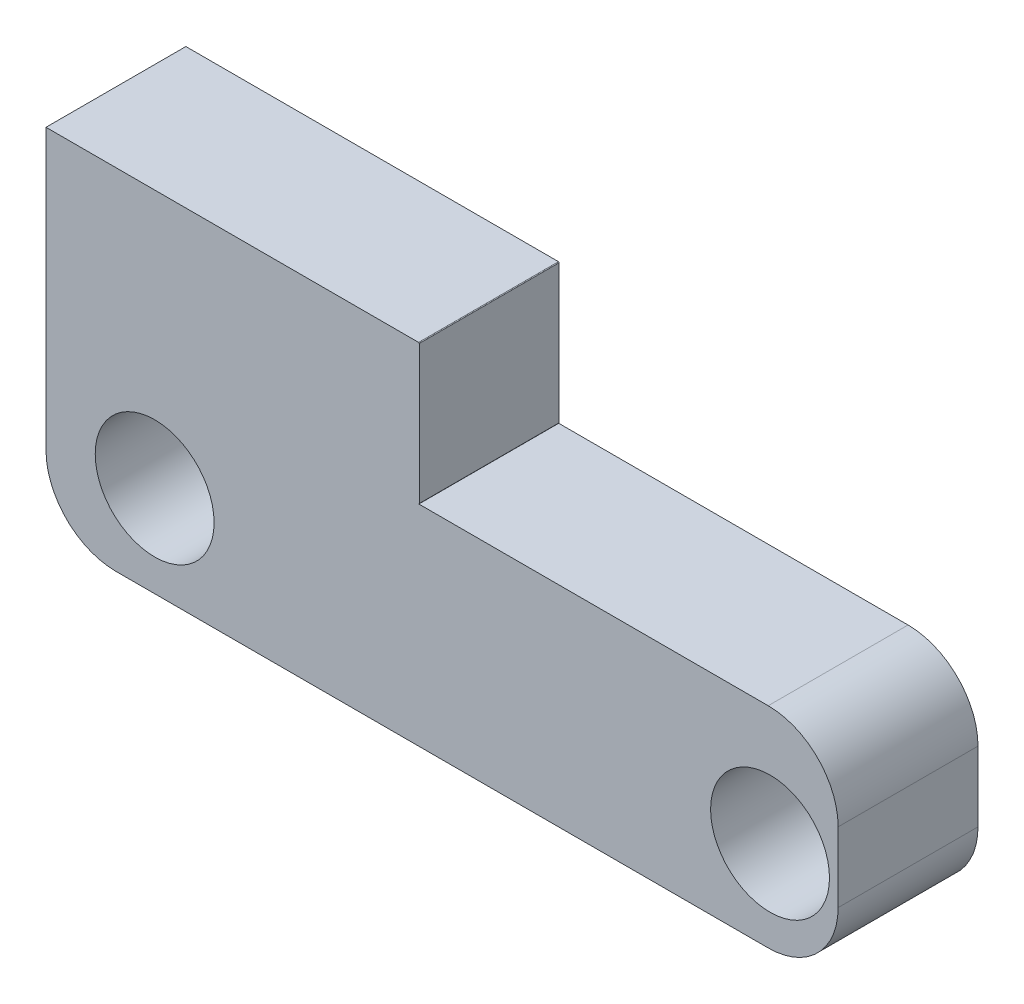
ISO-10303-21;
HEADER;
FILE_DESCRIPTION(('STEP AP214'),'2;1');
FILE_NAME('part.step','',(''),(''),'','','');
FILE_SCHEMA(('AUTOMOTIVE_DESIGN { 1 0 10303 214 1 1 1 1 }'));
ENDSEC;
DATA;
#1=APPLICATION_CONTEXT('core data for automotive mechanical design processes');
#2=APPLICATION_PROTOCOL_DEFINITION('international standard','automotive_design',2000,#1);
#3=PRODUCT_CONTEXT('',#1,'mechanical');
#4=PRODUCT('Part','Part','',(#3));
#5=PRODUCT_RELATED_PRODUCT_CATEGORY('part','',(#4));
#6=PRODUCT_DEFINITION_FORMATION('','',#4);
#7=PRODUCT_DEFINITION_CONTEXT('part definition',#1,'design');
#8=PRODUCT_DEFINITION('design','',#6,#7);
#9=PRODUCT_DEFINITION_SHAPE('','',#8);
#10=(LENGTH_UNIT() NAMED_UNIT(*) SI_UNIT(.MILLI.,.METRE.));
#11=(NAMED_UNIT(*) PLANE_ANGLE_UNIT() SI_UNIT($,.RADIAN.));
#12=(NAMED_UNIT(*) SI_UNIT($,.STERADIAN.) SOLID_ANGLE_UNIT());
#13=UNCERTAINTY_MEASURE_WITH_UNIT(LENGTH_MEASURE(1.E-05),#10,'distance_accuracy_value','');
#14=(GEOMETRIC_REPRESENTATION_CONTEXT(3) GLOBAL_UNCERTAINTY_ASSIGNED_CONTEXT((#13)) GLOBAL_UNIT_ASSIGNED_CONTEXT((#10,
#11,#12)) REPRESENTATION_CONTEXT('',''));
#15=CARTESIAN_POINT('',(0.,0.,0.));
#16=DIRECTION('',(0.,0.,1.));
#17=DIRECTION('',(1.,0.,0.));
#18=AXIS2_PLACEMENT_3D('',#15,#16,#17);
#19=CARTESIAN_POINT('',(-0.05,0.05,10.));
#20=DIRECTION('',(0.,0.,-1.));
#21=DIRECTION('',(-1.,0.,0.));
#22=AXIS2_PLACEMENT_3D('',#19,#20,#21);
#23=CYLINDRICAL_SURFACE('',#22,0.05);
#24=CARTESIAN_POINT('',(-0.05,0.05,0.));
#25=DIRECTION('',(0.,0.,1.));
#26=DIRECTION('',(1.,0.,0.));
#27=AXIS2_PLACEMENT_3D('',#24,#25,#26);
#28=CIRCLE('',#27,0.05);
#29=CARTESIAN_POINT('',(-0.05,0.,0.));
#30=VERTEX_POINT('',#29);
#31=CARTESIAN_POINT('',(0.,0.05,0.));
#32=VERTEX_POINT('',#31);
#33=EDGE_CURVE('E129',#30,#32,#28,.T.);
#34=ORIENTED_EDGE('',*,*,#33,.T.);
#35=DIRECTION('',(0.,0.,-1.));
#36=VECTOR('',#35,1.);
#37=CARTESIAN_POINT('',(0.,0.05,10.));
#38=LINE('',#37,#36);
#39=CARTESIAN_POINT('',(0.,0.05,10.));
#40=VERTEX_POINT('',#39);
#41=EDGE_CURVE('E133',#40,#32,#38,.T.);
#42=ORIENTED_EDGE('',*,*,#41,.F.);
#43=CARTESIAN_POINT('',(-0.05,0.05,10.));
#44=DIRECTION('',(0.,0.,1.));
#45=DIRECTION('',(1.,0.,0.));
#46=AXIS2_PLACEMENT_3D('',#43,#44,#45);
#47=CIRCLE('',#46,0.05);
#48=CARTESIAN_POINT('',(-0.05,0.,10.));
#49=VERTEX_POINT('',#48);
#50=EDGE_CURVE('E131',#49,#40,#47,.T.);
#51=ORIENTED_EDGE('',*,*,#50,.F.);
#52=DIRECTION('',(0.,0.,-1.));
#53=VECTOR('',#52,1.);
#54=CARTESIAN_POINT('',(-0.05,0.,10.));
#55=LINE('',#54,#53);
#56=EDGE_CURVE('E118',#49,#30,#55,.T.);
#57=ORIENTED_EDGE('',*,*,#56,.T.);
#58=EDGE_LOOP('',(#34,#42,#51,#57));
#59=FACE_BOUND('',#58,.T.);
#60=ADVANCED_FACE('F33',(#59),#23,.T.);
#61=CARTESIAN_POINT('',(0.,0.05,10.));
#62=DIRECTION('',(-1.,0.,0.));
#63=DIRECTION('',(0.,-1.,0.));
#64=AXIS2_PLACEMENT_3D('',#61,#62,#63);
#65=PLANE('',#64);
#66=DIRECTION('',(0.,1.,0.));
#67=VECTOR('',#66,1.);
#68=CARTESIAN_POINT('',(0.,0.05,0.));
#69=LINE('',#68,#67);
#70=CARTESIAN_POINT('',(0.,9.95,0.));
#71=VERTEX_POINT('',#70);
#72=EDGE_CURVE('E139',#32,#71,#69,.T.);
#73=ORIENTED_EDGE('',*,*,#72,.T.);
#74=DIRECTION('',(0.,0.,-1.));
#75=VECTOR('',#74,1.);
#76=CARTESIAN_POINT('',(0.,9.95,10.));
#77=LINE('',#76,#75);
#78=CARTESIAN_POINT('',(0.,9.95,10.));
#79=VERTEX_POINT('',#78);
#80=EDGE_CURVE('E162',#79,#71,#77,.T.);
#81=ORIENTED_EDGE('',*,*,#80,.F.);
#82=DIRECTION('',(0.,1.,0.));
#83=VECTOR('',#82,1.);
#84=CARTESIAN_POINT('',(0.,0.05,10.));
#85=LINE('',#84,#83);
#86=EDGE_CURVE('E206',#40,#79,#85,.T.);
#87=ORIENTED_EDGE('',*,*,#86,.F.);
#88=ORIENTED_EDGE('',*,*,#41,.T.);
#89=EDGE_LOOP('',(#73,#81,#87,#88));
#90=FACE_BOUND('',#89,.T.);
#91=ADVANCED_FACE('F236',(#90),#65,.F.);
#92=CARTESIAN_POINT('',(-0.05,9.95,10.));
#93=DIRECTION('',(0.,0.,-1.));
#94=DIRECTION('',(-1.,0.,0.));
#95=AXIS2_PLACEMENT_3D('',#92,#93,#94);
#96=CYLINDRICAL_SURFACE('',#95,0.0499999999999998);
#97=CARTESIAN_POINT('',(-0.05,9.95,0.));
#98=DIRECTION('',(0.,0.,1.));
#99=DIRECTION('',(1.,0.,0.));
#100=AXIS2_PLACEMENT_3D('',#97,#98,#99);
#101=CIRCLE('',#100,0.0499999999999998);
#102=CARTESIAN_POINT('',(-0.05,10.,0.));
#103=VERTEX_POINT('',#102);
#104=EDGE_CURVE('E142',#71,#103,#101,.T.);
#105=ORIENTED_EDGE('',*,*,#104,.T.);
#106=DIRECTION('',(0.,0.,-1.));
#107=VECTOR('',#106,1.);
#108=CARTESIAN_POINT('',(-0.05,10.,10.));
#109=LINE('',#108,#107);
#110=CARTESIAN_POINT('',(-0.05,10.,10.));
#111=VERTEX_POINT('',#110);
#112=EDGE_CURVE('E159',#111,#103,#109,.T.);
#113=ORIENTED_EDGE('',*,*,#112,.F.);
#114=CARTESIAN_POINT('',(-0.05,9.95,10.));
#115=DIRECTION('',(0.,0.,1.));
#116=DIRECTION('',(1.,0.,0.));
#117=AXIS2_PLACEMENT_3D('',#114,#115,#116);
#118=CIRCLE('',#117,0.0499999999999998);
#119=EDGE_CURVE('E208',#79,#111,#118,.T.);
#120=ORIENTED_EDGE('',*,*,#119,.F.);
#121=ORIENTED_EDGE('',*,*,#80,.T.);
#122=EDGE_LOOP('',(#105,#113,#120,#121));
#123=FACE_BOUND('',#122,.T.);
#124=ADVANCED_FACE('F231',(#123),#96,.T.);
#125=CARTESIAN_POINT('',(-0.05,10.,10.));
#126=DIRECTION('',(0.,-1.,0.));
#127=DIRECTION('',(0.,0.,-1.));
#128=AXIS2_PLACEMENT_3D('',#125,#126,#127);
#129=PLANE('',#128);
#130=DIRECTION('',(-1.,0.,0.));
#131=VECTOR('',#130,1.);
#132=CARTESIAN_POINT('',(-0.05,10.,0.));
#133=LINE('',#132,#131);
#134=CARTESIAN_POINT('',(-26.6892333331814,10.,0.));
#135=VERTEX_POINT('',#134);
#136=EDGE_CURVE('E151',#103,#135,#133,.T.);
#137=ORIENTED_EDGE('',*,*,#136,.T.);
#138=DIRECTION('',(0.,0.,-1.));
#139=VECTOR('',#138,1.);
#140=CARTESIAN_POINT('',(-26.6892333331814,10.,10.));
#141=LINE('',#140,#139);
#142=CARTESIAN_POINT('',(-26.6892333331814,10.,10.));
#143=VERTEX_POINT('',#142);
#144=EDGE_CURVE('E156',#143,#135,#141,.T.);
#145=ORIENTED_EDGE('',*,*,#144,.F.);
#146=DIRECTION('',(-1.,0.,0.));
#147=VECTOR('',#146,1.);
#148=CARTESIAN_POINT('',(-0.05,10.,10.));
#149=LINE('',#148,#147);
#150=EDGE_CURVE('E209',#111,#143,#149,.T.);
#151=ORIENTED_EDGE('',*,*,#150,.F.);
#152=ORIENTED_EDGE('',*,*,#112,.T.);
#153=EDGE_LOOP('',(#137,#145,#151,#152));
#154=FACE_BOUND('',#153,.T.);
#155=ADVANCED_FACE('F228',(#154),#129,.F.);
#156=CARTESIAN_POINT('',(-26.6892333331814,0.,10.));
#157=DIRECTION('',(1.,0.,0.));
#158=DIRECTION('',(0.,0.,-1.));
#159=AXIS2_PLACEMENT_3D('',#156,#157,#158);
#160=PLANE('',#159);
#161=DIRECTION('',(0.,-1.,0.));
#162=VECTOR('',#161,1.);
#163=CARTESIAN_POINT('',(-26.6892333331814,0.,0.));
#164=LINE('',#163,#162);
#165=CARTESIAN_POINT('',(-26.6892333331814,-10.,0.));
#166=VERTEX_POINT('',#165);
#167=EDGE_CURVE('E153',#135,#166,#164,.T.);
#168=ORIENTED_EDGE('',*,*,#167,.T.);
#169=DIRECTION('',(0.,0.,-1.));
#170=VECTOR('',#169,1.);
#171=CARTESIAN_POINT('',(-26.6892333331814,-10.,10.));
#172=LINE('',#171,#170);
#173=CARTESIAN_POINT('',(-26.6892333331814,-10.,10.));
#174=VERTEX_POINT('',#173);
#175=EDGE_CURVE('E176',#166,#174,#172,.F.);
#176=ORIENTED_EDGE('',*,*,#175,.T.);
#177=DIRECTION('',(0.,-1.,0.));
#178=VECTOR('',#177,1.);
#179=CARTESIAN_POINT('',(-26.6892333331814,0.,10.));
#180=LINE('',#179,#178);
#181=EDGE_CURVE('E147',#143,#174,#180,.T.);
#182=ORIENTED_EDGE('',*,*,#181,.F.);
#183=ORIENTED_EDGE('',*,*,#144,.T.);
#184=EDGE_LOOP('',(#168,#176,#182,#183));
#185=FACE_BOUND('',#184,.T.);
#186=ADVANCED_FACE('F226',(#185),#160,.F.);
#187=CARTESIAN_POINT('',(-0.05,0.05,10.));
#188=DIRECTION('',(0.,0.,1.));
#189=DIRECTION('',(1.,0.,0.));
#190=AXIS2_PLACEMENT_3D('',#187,#188,#189);
#191=PLANE('',#190);
#192=CARTESIAN_POINT('',(25.08,-8.47333778363474,10.));
#193=DIRECTION('',(0.,0.,1.));
#194=DIRECTION('',(1.,0.,0.));
#195=AXIS2_PLACEMENT_3D('',#192,#193,#194);
#196=CIRCLE('',#195,4.25000000000001);
#197=CARTESIAN_POINT('',(29.3300000000001,-8.47333778363474,10.));
#198=VERTEX_POINT('',#197);
#199=EDGE_CURVE('E195',#198,#198,#196,.T.);
#200=ORIENTED_EDGE('',*,*,#199,.F.);
#201=EDGE_LOOP('',(#200));
#202=FACE_BOUND('',#201,.T.);
#203=CARTESIAN_POINT('',(-18.9199999999999,-8.47333778363472,10.));
#204=DIRECTION('',(0.,0.,1.));
#205=DIRECTION('',(1.,0.,0.));
#206=AXIS2_PLACEMENT_3D('',#203,#204,#205);
#207=CIRCLE('',#206,4.25000000000001);
#208=CARTESIAN_POINT('',(-14.6699999999999,-8.47333778363472,10.));
#209=VERTEX_POINT('',#208);
#210=EDGE_CURVE('E199',#209,#209,#207,.T.);
#211=ORIENTED_EDGE('',*,*,#210,.F.);
#212=EDGE_LOOP('',(#211));
#213=FACE_BOUND('',#212,.T.);
#214=ORIENTED_EDGE('',*,*,#181,.T.);
#215=CARTESIAN_POINT('',(-21.6892333331814,-10.,10.));
#216=DIRECTION('',(0.,0.,1.));
#217=DIRECTION('',(1.,0.,0.));
#218=AXIS2_PLACEMENT_3D('',#215,#216,#217);
#219=CIRCLE('',#218,5.);
#220=CARTESIAN_POINT('',(-21.6892333331814,-15.,10.));
#221=VERTEX_POINT('',#220);
#222=EDGE_CURVE('E180',#174,#221,#219,.T.);
#223=ORIENTED_EDGE('',*,*,#222,.T.);
#224=DIRECTION('',(-1.,0.,0.));
#225=VECTOR('',#224,1.);
#226=CARTESIAN_POINT('',(-0.0499999999999997,-15.,10.));
#227=LINE('',#226,#225);
#228=CARTESIAN_POINT('',(24.95,-15.,10.));
#229=VERTEX_POINT('',#228);
#230=EDGE_CURVE('E140',#229,#221,#227,.T.);
#231=ORIENTED_EDGE('',*,*,#230,.F.);
#232=CARTESIAN_POINT('',(24.95,-10.,10.));
#233=DIRECTION('',(0.,0.,1.));
#234=DIRECTION('',(1.,0.,0.));
#235=AXIS2_PLACEMENT_3D('',#232,#233,#234);
#236=CIRCLE('',#235,5.);
#237=CARTESIAN_POINT('',(29.95,-10.,10.));
#238=VERTEX_POINT('',#237);
#239=EDGE_CURVE('E54',#229,#238,#236,.T.);
#240=ORIENTED_EDGE('',*,*,#239,.T.);
#241=DIRECTION('',(0.,-1.,0.));
#242=VECTOR('',#241,1.);
#243=CARTESIAN_POINT('',(29.95,0.,10.));
#244=LINE('',#243,#242);
#245=CARTESIAN_POINT('',(29.95,-5.,10.));
#246=VERTEX_POINT('',#245);
#247=EDGE_CURVE('E192',#246,#238,#244,.T.);
#248=ORIENTED_EDGE('',*,*,#247,.F.);
#249=CARTESIAN_POINT('',(24.95,-5.,10.));
#250=DIRECTION('',(0.,0.,1.));
#251=DIRECTION('',(1.,0.,0.));
#252=AXIS2_PLACEMENT_3D('',#249,#250,#251);
#253=CIRCLE('',#252,5.);
#254=CARTESIAN_POINT('',(24.95,0.,10.));
#255=VERTEX_POINT('',#254);
#256=EDGE_CURVE('E48',#246,#255,#253,.T.);
#257=ORIENTED_EDGE('',*,*,#256,.T.);
#258=DIRECTION('',(-1.,0.,0.));
#259=VECTOR('',#258,1.);
#260=CARTESIAN_POINT('',(29.95,0.,10.));
#261=LINE('',#260,#259);
#262=EDGE_CURVE('E125',#255,#49,#261,.T.);
#263=ORIENTED_EDGE('',*,*,#262,.T.);
#264=ORIENTED_EDGE('',*,*,#50,.T.);
#265=ORIENTED_EDGE('',*,*,#86,.T.);
#266=ORIENTED_EDGE('',*,*,#119,.T.);
#267=ORIENTED_EDGE('',*,*,#150,.T.);
#268=EDGE_LOOP('',(#214,#223,#231,#240,#248,#257,#263,#264,#265,#266,#267));
#269=FACE_BOUND('',#268,.T.);
#270=ADVANCED_FACE('F215',(#202,#213,#269),#191,.T.);
#271=CARTESIAN_POINT('',(-0.05,0.05,0.));
#272=DIRECTION('',(0.,0.,1.));
#273=DIRECTION('',(1.,0.,0.));
#274=AXIS2_PLACEMENT_3D('',#271,#272,#273);
#275=PLANE('',#274);
#276=CARTESIAN_POINT('',(25.08,-8.47333778363474,0.));
#277=DIRECTION('',(0.,0.,-1.));
#278=DIRECTION('',(-1.,0.,0.));
#279=AXIS2_PLACEMENT_3D('',#276,#277,#278);
#280=CIRCLE('',#279,4.25000000000001);
#281=CARTESIAN_POINT('',(20.83,-8.47333778363474,0.));
#282=VERTEX_POINT('',#281);
#283=EDGE_CURVE('E385',#282,#282,#280,.T.);
#284=ORIENTED_EDGE('',*,*,#283,.F.);
#285=EDGE_LOOP('',(#284));
#286=FACE_BOUND('',#285,.T.);
#287=CARTESIAN_POINT('',(-18.9199999999999,-8.47333778363472,0.));
#288=DIRECTION('',(0.,0.,-1.));
#289=DIRECTION('',(-1.,0.,0.));
#290=AXIS2_PLACEMENT_3D('',#287,#288,#289);
#291=CIRCLE('',#290,4.25000000000001);
#292=CARTESIAN_POINT('',(-23.1699999999999,-8.47333778363472,0.));
#293=VERTEX_POINT('',#292);
#294=EDGE_CURVE('E388',#293,#293,#291,.T.);
#295=ORIENTED_EDGE('',*,*,#294,.F.);
#296=EDGE_LOOP('',(#295));
#297=FACE_BOUND('',#296,.T.);
#298=DIRECTION('',(1.,0.,0.));
#299=VECTOR('',#298,1.);
#300=CARTESIAN_POINT('',(-26.6892333331814,-15.,0.));
#301=LINE('',#300,#299);
#302=CARTESIAN_POINT('',(-21.6892333331814,-15.,0.));
#303=VERTEX_POINT('',#302);
#304=CARTESIAN_POINT('',(24.95,-15.,0.));
#305=VERTEX_POINT('',#304);
#306=EDGE_CURVE('E124',#303,#305,#301,.T.);
#307=ORIENTED_EDGE('',*,*,#306,.F.);
#308=CARTESIAN_POINT('',(-21.6892333331814,-10.,0.));
#309=DIRECTION('',(0.,0.,1.));
#310=DIRECTION('',(1.,0.,0.));
#311=AXIS2_PLACEMENT_3D('',#308,#309,#310);
#312=CIRCLE('',#311,5.);
#313=EDGE_CURVE('E174',#303,#166,#312,.F.);
#314=ORIENTED_EDGE('',*,*,#313,.T.);
#315=ORIENTED_EDGE('',*,*,#167,.F.);
#316=ORIENTED_EDGE('',*,*,#136,.F.);
#317=ORIENTED_EDGE('',*,*,#104,.F.);
#318=ORIENTED_EDGE('',*,*,#72,.F.);
#319=ORIENTED_EDGE('',*,*,#33,.F.);
#320=DIRECTION('',(-1.,0.,0.));
#321=VECTOR('',#320,1.);
#322=CARTESIAN_POINT('',(29.95,0.,0.));
#323=LINE('',#322,#321);
#324=CARTESIAN_POINT('',(24.95,0.,0.));
#325=VERTEX_POINT('',#324);
#326=EDGE_CURVE('E115',#325,#30,#323,.T.);
#327=ORIENTED_EDGE('',*,*,#326,.F.);
#328=CARTESIAN_POINT('',(24.95,-5.,0.));
#329=DIRECTION('',(0.,0.,1.));
#330=DIRECTION('',(1.,0.,0.));
#331=AXIS2_PLACEMENT_3D('',#328,#329,#330);
#332=CIRCLE('',#331,5.);
#333=CARTESIAN_POINT('',(29.95,-5.,0.));
#334=VERTEX_POINT('',#333);
#335=EDGE_CURVE('E170',#325,#334,#332,.F.);
#336=ORIENTED_EDGE('',*,*,#335,.T.);
#337=DIRECTION('',(0.,1.,0.));
#338=VECTOR('',#337,1.);
#339=CARTESIAN_POINT('',(29.95,-15.,0.));
#340=LINE('',#339,#338);
#341=CARTESIAN_POINT('',(29.95,-10.,0.));
#342=VERTEX_POINT('',#341);
#343=EDGE_CURVE('E190',#342,#334,#340,.T.);
#344=ORIENTED_EDGE('',*,*,#343,.F.);
#345=CARTESIAN_POINT('',(24.95,-10.,0.));
#346=DIRECTION('',(0.,0.,1.));
#347=DIRECTION('',(1.,0.,0.));
#348=AXIS2_PLACEMENT_3D('',#345,#346,#347);
#349=CIRCLE('',#348,5.);
#350=EDGE_CURVE('E172',#342,#305,#349,.F.);
#351=ORIENTED_EDGE('',*,*,#350,.T.);
#352=EDGE_LOOP('',(#307,#314,#315,#316,#317,#318,#319,#327,#336,#344,#351));
#353=FACE_BOUND('',#352,.T.);
#354=ADVANCED_FACE('F137',(#286,#297,#353),#275,.F.);
#355=CARTESIAN_POINT('',(0.,-15.,0.));
#356=DIRECTION('',(0.,-1.,0.));
#357=DIRECTION('',(1.,0.,0.));
#358=AXIS2_PLACEMENT_3D('',#355,#356,#357);
#359=PLANE('',#358);
#360=ORIENTED_EDGE('',*,*,#230,.T.);
#361=DIRECTION('',(0.,0.,-1.));
#362=VECTOR('',#361,1.);
#363=CARTESIAN_POINT('',(-21.6892333331814,-15.,0.));
#364=LINE('',#363,#362);
#365=EDGE_CURVE('E167',#221,#303,#364,.T.);
#366=ORIENTED_EDGE('',*,*,#365,.T.);
#367=ORIENTED_EDGE('',*,*,#306,.T.);
#368=DIRECTION('',(0.,0.,-1.));
#369=VECTOR('',#368,1.);
#370=CARTESIAN_POINT('',(24.95,-15.,0.));
#371=LINE('',#370,#369);
#372=EDGE_CURVE('E132',#305,#229,#371,.F.);
#373=ORIENTED_EDGE('',*,*,#372,.T.);
#374=EDGE_LOOP('',(#360,#366,#367,#373));
#375=FACE_BOUND('',#374,.T.);
#376=ADVANCED_FACE('F222',(#375),#359,.T.);
#377=CARTESIAN_POINT('',(29.95,0.,0.));
#378=DIRECTION('',(0.,-1.,0.));
#379=DIRECTION('',(1.,0.,0.));
#380=AXIS2_PLACEMENT_3D('',#377,#378,#379);
#381=PLANE('',#380);
#382=ORIENTED_EDGE('',*,*,#262,.F.);
#383=DIRECTION('',(0.,0.,1.));
#384=VECTOR('',#383,1.);
#385=CARTESIAN_POINT('',(24.95,0.,0.));
#386=LINE('',#385,#384);
#387=EDGE_CURVE('E11',#255,#325,#386,.F.);
#388=ORIENTED_EDGE('',*,*,#387,.T.);
#389=ORIENTED_EDGE('',*,*,#326,.T.);
#390=ORIENTED_EDGE('',*,*,#56,.F.);
#391=EDGE_LOOP('',(#382,#388,#389,#390));
#392=FACE_BOUND('',#391,.T.);
#393=ADVANCED_FACE('F117',(#392),#381,.F.);
#394=CARTESIAN_POINT('',(29.95,0.,0.));
#395=DIRECTION('',(1.,0.,0.));
#396=DIRECTION('',(0.,1.,0.));
#397=AXIS2_PLACEMENT_3D('',#394,#395,#396);
#398=PLANE('',#397);
#399=ORIENTED_EDGE('',*,*,#247,.T.);
#400=DIRECTION('',(0.,0.,-1.));
#401=VECTOR('',#400,1.);
#402=CARTESIAN_POINT('',(29.95,-10.,0.));
#403=LINE('',#402,#401);
#404=EDGE_CURVE('E41',#238,#342,#403,.T.);
#405=ORIENTED_EDGE('',*,*,#404,.T.);
#406=ORIENTED_EDGE('',*,*,#343,.T.);
#407=DIRECTION('',(0.,0.,1.));
#408=VECTOR('',#407,1.);
#409=CARTESIAN_POINT('',(29.95,-5.,10.));
#410=LINE('',#409,#408);
#411=EDGE_CURVE('E182',#334,#246,#410,.T.);
#412=ORIENTED_EDGE('',*,*,#411,.T.);
#413=EDGE_LOOP('',(#399,#405,#406,#412));
#414=FACE_BOUND('',#413,.T.);
#415=ADVANCED_FACE('F189',(#414),#398,.T.);
#416=CARTESIAN_POINT('',(-18.9199999999999,-8.47333778363472,30.));
#417=DIRECTION('',(0.,0.,-1.));
#418=DIRECTION('',(-1.,0.,0.));
#419=AXIS2_PLACEMENT_3D('',#416,#417,#418);
#420=CYLINDRICAL_SURFACE('',#419,4.25000000000001);
#421=ORIENTED_EDGE('',*,*,#210,.T.);
#422=EDGE_LOOP('',(#421));
#423=FACE_BOUND('',#422,.T.);
#424=ORIENTED_EDGE('',*,*,#294,.T.);
#425=EDGE_LOOP('',(#424));
#426=FACE_BOUND('',#425,.T.);
#427=ADVANCED_FACE('F256',(#423,#426),#420,.F.);
#428=CARTESIAN_POINT('',(25.08,-8.47333778363474,30.));
#429=DIRECTION('',(0.,0.,-1.));
#430=DIRECTION('',(-1.,0.,0.));
#431=AXIS2_PLACEMENT_3D('',#428,#429,#430);
#432=CYLINDRICAL_SURFACE('',#431,4.25000000000001);
#433=ORIENTED_EDGE('',*,*,#199,.T.);
#434=EDGE_LOOP('',(#433));
#435=FACE_BOUND('',#434,.T.);
#436=ORIENTED_EDGE('',*,*,#283,.T.);
#437=EDGE_LOOP('',(#436));
#438=FACE_BOUND('',#437,.T.);
#439=ADVANCED_FACE('F252',(#435,#438),#432,.F.);
#440=CARTESIAN_POINT('',(-21.6892333331814,-10.,0.));
#441=DIRECTION('',(0.,0.,1.));
#442=DIRECTION('',(1.,0.,0.));
#443=AXIS2_PLACEMENT_3D('',#440,#441,#442);
#444=CYLINDRICAL_SURFACE('',#443,5.);
#445=ORIENTED_EDGE('',*,*,#222,.F.);
#446=ORIENTED_EDGE('',*,*,#175,.F.);
#447=ORIENTED_EDGE('',*,*,#313,.F.);
#448=ORIENTED_EDGE('',*,*,#365,.F.);
#449=EDGE_LOOP('',(#445,#446,#447,#448));
#450=FACE_BOUND('',#449,.T.);
#451=ADVANCED_FACE('F220',(#450),#444,.T.);
#452=CARTESIAN_POINT('',(24.95,-10.,0.));
#453=DIRECTION('',(0.,0.,-1.));
#454=DIRECTION('',(-1.,0.,0.));
#455=AXIS2_PLACEMENT_3D('',#452,#453,#454);
#456=CYLINDRICAL_SURFACE('',#455,5.);
#457=ORIENTED_EDGE('',*,*,#239,.F.);
#458=ORIENTED_EDGE('',*,*,#372,.F.);
#459=ORIENTED_EDGE('',*,*,#350,.F.);
#460=ORIENTED_EDGE('',*,*,#404,.F.);
#461=EDGE_LOOP('',(#457,#458,#459,#460));
#462=FACE_BOUND('',#461,.T.);
#463=ADVANCED_FACE('F239',(#462),#456,.T.);
#464=CARTESIAN_POINT('',(24.95,-5.,0.));
#465=DIRECTION('',(0.,0.,-1.));
#466=DIRECTION('',(0.,1.,0.));
#467=AXIS2_PLACEMENT_3D('',#464,#465,#466);
#468=CYLINDRICAL_SURFACE('',#467,5.);
#469=ORIENTED_EDGE('',*,*,#335,.F.);
#470=ORIENTED_EDGE('',*,*,#387,.F.);
#471=ORIENTED_EDGE('',*,*,#256,.F.);
#472=ORIENTED_EDGE('',*,*,#411,.F.);
#473=EDGE_LOOP('',(#469,#470,#471,#472));
#474=FACE_BOUND('',#473,.T.);
#475=ADVANCED_FACE('F35',(#474),#468,.T.);
#476=CLOSED_SHELL('',(#60,#91,#124,#155,#186,#270,#354,#376,#393,#415,#427,#439,#451,#463,#475));
#477=MANIFOLD_SOLID_BREP('B2',#476);
#478=ADVANCED_BREP_SHAPE_REPRESENTATION('',(#18,#477),#14);
#479=SHAPE_DEFINITION_REPRESENTATION(#9,#478);
ENDSEC;
END-ISO-10303-21;
